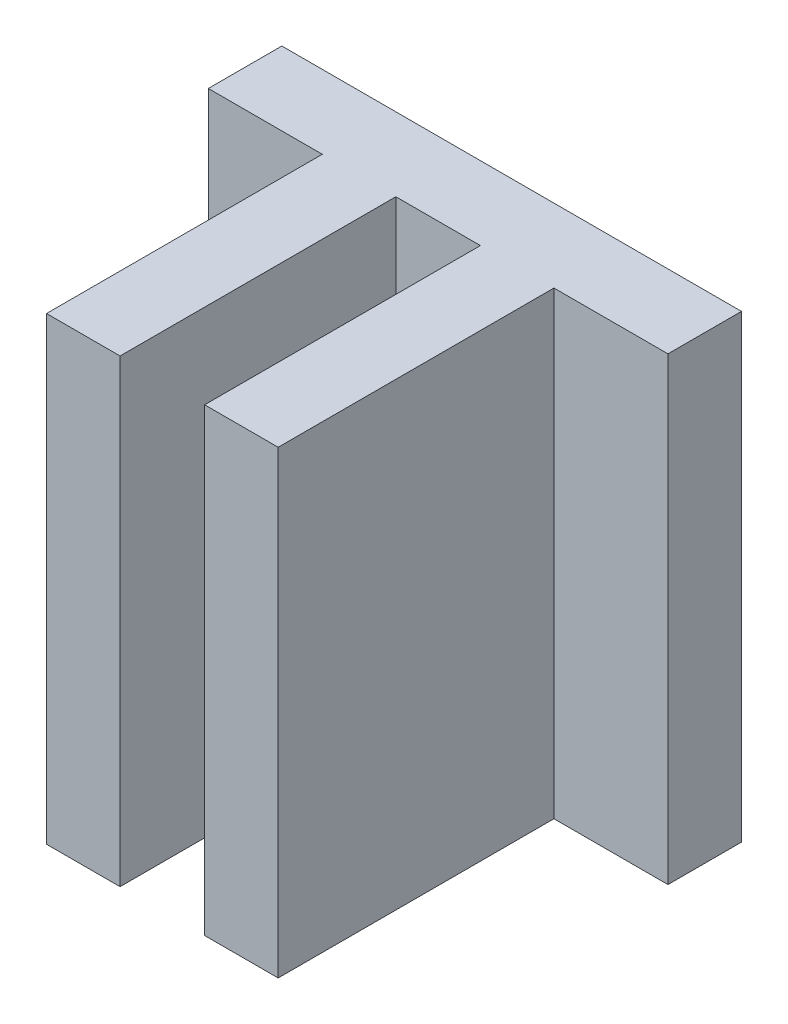
ISO-10303-21;
HEADER;
FILE_DESCRIPTION(('STEP AP214'),'2;1');
FILE_NAME('part.step','',(''),(''),'','','');
FILE_SCHEMA(('AUTOMOTIVE_DESIGN { 1 0 10303 214 1 1 1 1 }'));
ENDSEC;
DATA;
#1=APPLICATION_CONTEXT('core data for automotive mechanical design processes');
#2=APPLICATION_PROTOCOL_DEFINITION('international standard','automotive_design',2000,#1);
#3=PRODUCT_CONTEXT('',#1,'mechanical');
#4=PRODUCT('Part','Part','',(#3));
#5=PRODUCT_RELATED_PRODUCT_CATEGORY('part','',(#4));
#6=PRODUCT_DEFINITION_FORMATION('','',#4);
#7=PRODUCT_DEFINITION_CONTEXT('part definition',#1,'design');
#8=PRODUCT_DEFINITION('design','',#6,#7);
#9=PRODUCT_DEFINITION_SHAPE('','',#8);
#10=(LENGTH_UNIT() NAMED_UNIT(*) SI_UNIT(.MILLI.,.METRE.));
#11=(NAMED_UNIT(*) PLANE_ANGLE_UNIT() SI_UNIT($,.RADIAN.));
#12=(NAMED_UNIT(*) SI_UNIT($,.STERADIAN.) SOLID_ANGLE_UNIT());
#13=UNCERTAINTY_MEASURE_WITH_UNIT(LENGTH_MEASURE(1.E-05),#10,'distance_accuracy_value','');
#14=(GEOMETRIC_REPRESENTATION_CONTEXT(3) GLOBAL_UNCERTAINTY_ASSIGNED_CONTEXT((#13)) GLOBAL_UNIT_ASSIGNED_CONTEXT((#10,
#11,#12)) REPRESENTATION_CONTEXT('',''));
#15=CARTESIAN_POINT('',(0.,0.,0.));
#16=DIRECTION('',(0.,0.,1.));
#17=DIRECTION('',(1.,0.,0.));
#18=AXIS2_PLACEMENT_3D('',#15,#16,#17);
#19=CARTESIAN_POINT('',(1.4605,15.875,0.));
#20=DIRECTION('',(-1.,0.,0.));
#21=DIRECTION('',(0.,0.,1.));
#22=AXIS2_PLACEMENT_3D('',#19,#20,#21);
#23=PLANE('',#22);
#24=DIRECTION('',(0.,0.,-1.));
#25=VECTOR('',#24,1.);
#26=CARTESIAN_POINT('',(1.4605,0.,0.));
#27=LINE('',#26,#25);
#28=CARTESIAN_POINT('',(1.4605,0.,9.525));
#29=VERTEX_POINT('',#28);
#30=CARTESIAN_POINT('',(1.4605,0.,0.));
#31=VERTEX_POINT('',#30);
#32=EDGE_CURVE('E156',#29,#31,#27,.T.);
#33=ORIENTED_EDGE('',*,*,#32,.F.);
#34=DIRECTION('',(0.,-1.,0.));
#35=VECTOR('',#34,1.);
#36=CARTESIAN_POINT('',(1.4605,15.875,9.525));
#37=LINE('',#36,#35);
#38=CARTESIAN_POINT('',(1.4605,15.875,9.525));
#39=VERTEX_POINT('',#38);
#40=EDGE_CURVE('E11',#39,#29,#37,.T.);
#41=ORIENTED_EDGE('',*,*,#40,.F.);
#42=DIRECTION('',(0.,0.,-1.));
#43=VECTOR('',#42,1.);
#44=CARTESIAN_POINT('',(1.4605,15.875,0.));
#45=LINE('',#44,#43);
#46=CARTESIAN_POINT('',(1.4605,15.875,0.));
#47=VERTEX_POINT('',#46);
#48=EDGE_CURVE('E184',#39,#47,#45,.T.);
#49=ORIENTED_EDGE('',*,*,#48,.T.);
#50=DIRECTION('',(0.,-1.,0.));
#51=VECTOR('',#50,1.);
#52=CARTESIAN_POINT('',(1.4605,15.875,0.));
#53=LINE('',#52,#51);
#54=EDGE_CURVE('E99',#47,#31,#53,.T.);
#55=ORIENTED_EDGE('',*,*,#54,.T.);
#56=EDGE_LOOP('',(#33,#41,#49,#55));
#57=FACE_BOUND('',#56,.T.);
#58=ADVANCED_FACE('F36',(#57),#23,.T.);
#59=CARTESIAN_POINT('',(0.,15.875,9.525));
#60=DIRECTION('',(0.,0.,-1.));
#61=DIRECTION('',(-1.,0.,0.));
#62=AXIS2_PLACEMENT_3D('',#59,#60,#61);
#63=PLANE('',#62);
#64=DIRECTION('',(1.,0.,0.));
#65=VECTOR('',#64,1.);
#66=CARTESIAN_POINT('',(0.,0.,9.525));
#67=LINE('',#66,#65);
#68=CARTESIAN_POINT('',(4.0005,0.,9.525));
#69=VERTEX_POINT('',#68);
#70=EDGE_CURVE('E159',#29,#69,#67,.T.);
#71=ORIENTED_EDGE('',*,*,#70,.T.);
#72=DIRECTION('',(0.,-1.,0.));
#73=VECTOR('',#72,1.);
#74=CARTESIAN_POINT('',(4.0005,15.875,9.525));
#75=LINE('',#74,#73);
#76=CARTESIAN_POINT('',(4.0005,15.875,9.525));
#77=VERTEX_POINT('',#76);
#78=EDGE_CURVE('E44',#77,#69,#75,.T.);
#79=ORIENTED_EDGE('',*,*,#78,.F.);
#80=DIRECTION('',(1.,0.,0.));
#81=VECTOR('',#80,1.);
#82=CARTESIAN_POINT('',(0.,15.875,9.525));
#83=LINE('',#82,#81);
#84=EDGE_CURVE('E142',#39,#77,#83,.T.);
#85=ORIENTED_EDGE('',*,*,#84,.F.);
#86=ORIENTED_EDGE('',*,*,#40,.T.);
#87=EDGE_LOOP('',(#71,#79,#85,#86));
#88=FACE_BOUND('',#87,.T.);
#89=ADVANCED_FACE('F209',(#88),#63,.F.);
#90=CARTESIAN_POINT('',(4.0005,15.875,0.));
#91=DIRECTION('',(1.,0.,0.));
#92=DIRECTION('',(0.,0.,-1.));
#93=AXIS2_PLACEMENT_3D('',#90,#91,#92);
#94=PLANE('',#93);
#95=DIRECTION('',(0.,0.,1.));
#96=VECTOR('',#95,1.);
#97=CARTESIAN_POINT('',(4.0005,0.,0.));
#98=LINE('',#97,#96);
#99=CARTESIAN_POINT('',(4.0005,0.,0.));
#100=VERTEX_POINT('',#99);
#101=EDGE_CURVE('E162',#100,#69,#98,.T.);
#102=ORIENTED_EDGE('',*,*,#101,.F.);
#103=DIRECTION('',(0.,-1.,0.));
#104=VECTOR('',#103,1.);
#105=CARTESIAN_POINT('',(4.0005,15.875,0.));
#106=LINE('',#105,#104);
#107=CARTESIAN_POINT('',(4.0005,15.875,0.));
#108=VERTEX_POINT('',#107);
#109=EDGE_CURVE('E199',#108,#100,#106,.T.);
#110=ORIENTED_EDGE('',*,*,#109,.F.);
#111=DIRECTION('',(0.,0.,1.));
#112=VECTOR('',#111,1.);
#113=CARTESIAN_POINT('',(4.0005,15.875,0.));
#114=LINE('',#113,#112);
#115=EDGE_CURVE('E206',#108,#77,#114,.T.);
#116=ORIENTED_EDGE('',*,*,#115,.T.);
#117=ORIENTED_EDGE('',*,*,#78,.T.);
#118=EDGE_LOOP('',(#102,#110,#116,#117));
#119=FACE_BOUND('',#118,.T.);
#120=ADVANCED_FACE('F204',(#119),#94,.T.);
#121=CARTESIAN_POINT('',(0.,15.875,0.));
#122=DIRECTION('',(0.,0.,-1.));
#123=DIRECTION('',(-1.,0.,0.));
#124=AXIS2_PLACEMENT_3D('',#121,#122,#123);
#125=PLANE('',#124);
#126=DIRECTION('',(1.,0.,0.));
#127=VECTOR('',#126,1.);
#128=CARTESIAN_POINT('',(0.,0.,0.));
#129=LINE('',#128,#127);
#130=CARTESIAN_POINT('',(7.9375,0.,0.));
#131=VERTEX_POINT('',#130);
#132=EDGE_CURVE('E165',#100,#131,#129,.T.);
#133=ORIENTED_EDGE('',*,*,#132,.T.);
#134=DIRECTION('',(0.,-1.,0.));
#135=VECTOR('',#134,1.);
#136=CARTESIAN_POINT('',(7.9375,15.875,0.));
#137=LINE('',#136,#135);
#138=CARTESIAN_POINT('',(7.9375,15.875,0.));
#139=VERTEX_POINT('',#138);
#140=EDGE_CURVE('E196',#139,#131,#137,.T.);
#141=ORIENTED_EDGE('',*,*,#140,.F.);
#142=DIRECTION('',(1.,0.,0.));
#143=VECTOR('',#142,1.);
#144=CARTESIAN_POINT('',(0.,15.875,0.));
#145=LINE('',#144,#143);
#146=EDGE_CURVE('E226',#108,#139,#145,.T.);
#147=ORIENTED_EDGE('',*,*,#146,.F.);
#148=ORIENTED_EDGE('',*,*,#109,.T.);
#149=EDGE_LOOP('',(#133,#141,#147,#148));
#150=FACE_BOUND('',#149,.T.);
#151=ADVANCED_FACE('F216',(#150),#125,.F.);
#152=CARTESIAN_POINT('',(7.9375,15.875,0.));
#153=DIRECTION('',(-1.,0.,0.));
#154=DIRECTION('',(0.,0.,1.));
#155=AXIS2_PLACEMENT_3D('',#152,#153,#154);
#156=PLANE('',#155);
#157=DIRECTION('',(0.,0.,-1.));
#158=VECTOR('',#157,1.);
#159=CARTESIAN_POINT('',(7.9375,0.,0.));
#160=LINE('',#159,#158);
#161=CARTESIAN_POINT('',(7.9375,0.,-2.54));
#162=VERTEX_POINT('',#161);
#163=EDGE_CURVE('E167',#131,#162,#160,.T.);
#164=ORIENTED_EDGE('',*,*,#163,.T.);
#165=DIRECTION('',(0.,-1.,0.));
#166=VECTOR('',#165,1.);
#167=CARTESIAN_POINT('',(7.9375,15.875,-2.54));
#168=LINE('',#167,#166);
#169=CARTESIAN_POINT('',(7.9375,15.875,-2.54));
#170=VERTEX_POINT('',#169);
#171=EDGE_CURVE('E194',#170,#162,#168,.T.);
#172=ORIENTED_EDGE('',*,*,#171,.F.);
#173=DIRECTION('',(0.,0.,-1.));
#174=VECTOR('',#173,1.);
#175=CARTESIAN_POINT('',(7.9375,15.875,0.));
#176=LINE('',#175,#174);
#177=EDGE_CURVE('E222',#139,#170,#176,.T.);
#178=ORIENTED_EDGE('',*,*,#177,.F.);
#179=ORIENTED_EDGE('',*,*,#140,.T.);
#180=EDGE_LOOP('',(#164,#172,#178,#179));
#181=FACE_BOUND('',#180,.T.);
#182=ADVANCED_FACE('F220',(#181),#156,.F.);
#183=CARTESIAN_POINT('',(0.,15.875,-2.54));
#184=DIRECTION('',(0.,0.,-1.));
#185=DIRECTION('',(-1.,0.,0.));
#186=AXIS2_PLACEMENT_3D('',#183,#184,#185);
#187=PLANE('',#186);
#188=DIRECTION('',(1.,0.,0.));
#189=VECTOR('',#188,1.);
#190=CARTESIAN_POINT('',(0.,0.,-2.54));
#191=LINE('',#190,#189);
#192=CARTESIAN_POINT('',(-7.9375,0.,-2.54));
#193=VERTEX_POINT('',#192);
#194=EDGE_CURVE('E170',#193,#162,#191,.T.);
#195=ORIENTED_EDGE('',*,*,#194,.F.);
#196=DIRECTION('',(0.,-1.,0.));
#197=VECTOR('',#196,1.);
#198=CARTESIAN_POINT('',(-7.9375,15.875,-2.54));
#199=LINE('',#198,#197);
#200=CARTESIAN_POINT('',(-7.9375,15.875,-2.54));
#201=VERTEX_POINT('',#200);
#202=EDGE_CURVE('E192',#201,#193,#199,.T.);
#203=ORIENTED_EDGE('',*,*,#202,.F.);
#204=DIRECTION('',(1.,0.,0.));
#205=VECTOR('',#204,1.);
#206=CARTESIAN_POINT('',(0.,15.875,-2.54));
#207=LINE('',#206,#205);
#208=EDGE_CURVE('E225',#201,#170,#207,.T.);
#209=ORIENTED_EDGE('',*,*,#208,.T.);
#210=ORIENTED_EDGE('',*,*,#171,.T.);
#211=EDGE_LOOP('',(#195,#203,#209,#210));
#212=FACE_BOUND('',#211,.T.);
#213=ADVANCED_FACE('F318',(#212),#187,.T.);
#214=CARTESIAN_POINT('',(-7.9375,15.875,0.));
#215=DIRECTION('',(-1.,0.,0.));
#216=DIRECTION('',(0.,0.,1.));
#217=AXIS2_PLACEMENT_3D('',#214,#215,#216);
#218=PLANE('',#217);
#219=DIRECTION('',(0.,0.,-1.));
#220=VECTOR('',#219,1.);
#221=CARTESIAN_POINT('',(-7.9375,0.,0.));
#222=LINE('',#221,#220);
#223=CARTESIAN_POINT('',(-7.9375,0.,0.));
#224=VERTEX_POINT('',#223);
#225=EDGE_CURVE('E173',#224,#193,#222,.T.);
#226=ORIENTED_EDGE('',*,*,#225,.F.);
#227=DIRECTION('',(0.,-1.,0.));
#228=VECTOR('',#227,1.);
#229=CARTESIAN_POINT('',(-7.9375,15.875,0.));
#230=LINE('',#229,#228);
#231=CARTESIAN_POINT('',(-7.9375,15.875,0.));
#232=VERTEX_POINT('',#231);
#233=EDGE_CURVE('E190',#232,#224,#230,.T.);
#234=ORIENTED_EDGE('',*,*,#233,.F.);
#235=DIRECTION('',(0.,0.,-1.));
#236=VECTOR('',#235,1.);
#237=CARTESIAN_POINT('',(-7.9375,15.875,0.));
#238=LINE('',#237,#236);
#239=EDGE_CURVE('E228',#232,#201,#238,.T.);
#240=ORIENTED_EDGE('',*,*,#239,.T.);
#241=ORIENTED_EDGE('',*,*,#202,.T.);
#242=EDGE_LOOP('',(#226,#234,#240,#241));
#243=FACE_BOUND('',#242,.T.);
#244=ADVANCED_FACE('F242',(#243),#218,.T.);
#245=CARTESIAN_POINT('',(0.,15.875,0.));
#246=DIRECTION('',(0.,0.,1.));
#247=DIRECTION('',(1.,0.,0.));
#248=AXIS2_PLACEMENT_3D('',#245,#246,#247);
#249=PLANE('',#248);
#250=DIRECTION('',(-1.,0.,0.));
#251=VECTOR('',#250,1.);
#252=CARTESIAN_POINT('',(0.,0.,0.));
#253=LINE('',#252,#251);
#254=CARTESIAN_POINT('',(-4.0005,0.,0.));
#255=VERTEX_POINT('',#254);
#256=EDGE_CURVE('E176',#255,#224,#253,.T.);
#257=ORIENTED_EDGE('',*,*,#256,.F.);
#258=DIRECTION('',(0.,-1.,0.));
#259=VECTOR('',#258,1.);
#260=CARTESIAN_POINT('',(-4.0005,15.875,0.));
#261=LINE('',#260,#259);
#262=CARTESIAN_POINT('',(-4.0005,15.875,0.));
#263=VERTEX_POINT('',#262);
#264=EDGE_CURVE('E188',#263,#255,#261,.T.);
#265=ORIENTED_EDGE('',*,*,#264,.F.);
#266=DIRECTION('',(-1.,0.,0.));
#267=VECTOR('',#266,1.);
#268=CARTESIAN_POINT('',(0.,15.875,0.));
#269=LINE('',#268,#267);
#270=EDGE_CURVE('E234',#263,#232,#269,.T.);
#271=ORIENTED_EDGE('',*,*,#270,.T.);
#272=ORIENTED_EDGE('',*,*,#233,.T.);
#273=EDGE_LOOP('',(#257,#265,#271,#272));
#274=FACE_BOUND('',#273,.T.);
#275=ADVANCED_FACE('F238',(#274),#249,.T.);
#276=CARTESIAN_POINT('',(-4.0005,15.875,0.));
#277=DIRECTION('',(1.,0.,0.));
#278=DIRECTION('',(0.,0.,-1.));
#279=AXIS2_PLACEMENT_3D('',#276,#277,#278);
#280=PLANE('',#279);
#281=DIRECTION('',(0.,0.,1.));
#282=VECTOR('',#281,1.);
#283=CARTESIAN_POINT('',(-4.0005,0.,0.));
#284=LINE('',#283,#282);
#285=CARTESIAN_POINT('',(-4.0005,0.,9.525));
#286=VERTEX_POINT('',#285);
#287=EDGE_CURVE('E179',#255,#286,#284,.T.);
#288=ORIENTED_EDGE('',*,*,#287,.T.);
#289=DIRECTION('',(0.,-1.,0.));
#290=VECTOR('',#289,1.);
#291=CARTESIAN_POINT('',(-4.0005,15.875,9.525));
#292=LINE('',#291,#290);
#293=CARTESIAN_POINT('',(-4.0005,15.875,9.525));
#294=VERTEX_POINT('',#293);
#295=EDGE_CURVE('E147',#294,#286,#292,.T.);
#296=ORIENTED_EDGE('',*,*,#295,.F.);
#297=DIRECTION('',(0.,0.,1.));
#298=VECTOR('',#297,1.);
#299=CARTESIAN_POINT('',(-4.0005,15.875,0.));
#300=LINE('',#299,#298);
#301=EDGE_CURVE('E137',#263,#294,#300,.T.);
#302=ORIENTED_EDGE('',*,*,#301,.F.);
#303=ORIENTED_EDGE('',*,*,#264,.T.);
#304=EDGE_LOOP('',(#288,#296,#302,#303));
#305=FACE_BOUND('',#304,.T.);
#306=ADVANCED_FACE('F246',(#305),#280,.F.);
#307=CARTESIAN_POINT('',(-1.4605,0.,9.525));
#308=VERTEX_POINT('',#307);
#309=EDGE_CURVE('E146',#286,#308,#67,.T.);
#310=ORIENTED_EDGE('',*,*,#309,.T.);
#311=DIRECTION('',(0.,-1.,0.));
#312=VECTOR('',#311,1.);
#313=CARTESIAN_POINT('',(-1.4605,15.875,9.525));
#314=LINE('',#313,#312);
#315=CARTESIAN_POINT('',(-1.4605,15.875,9.525));
#316=VERTEX_POINT('',#315);
#317=EDGE_CURVE('E143',#316,#308,#314,.T.);
#318=ORIENTED_EDGE('',*,*,#317,.F.);
#319=EDGE_CURVE('E130',#294,#316,#83,.T.);
#320=ORIENTED_EDGE('',*,*,#319,.F.);
#321=ORIENTED_EDGE('',*,*,#295,.T.);
#322=EDGE_LOOP('',(#310,#318,#320,#321));
#323=FACE_BOUND('',#322,.T.);
#324=ADVANCED_FACE('F144',(#323),#63,.F.);
#325=CARTESIAN_POINT('',(-1.4605,15.875,0.));
#326=DIRECTION('',(-1.,0.,0.));
#327=DIRECTION('',(0.,0.,1.));
#328=AXIS2_PLACEMENT_3D('',#325,#326,#327);
#329=PLANE('',#328);
#330=DIRECTION('',(0.,0.,-1.));
#331=VECTOR('',#330,1.);
#332=CARTESIAN_POINT('',(-1.4605,0.,0.));
#333=LINE('',#332,#331);
#334=CARTESIAN_POINT('',(-1.4605,0.,0.));
#335=VERTEX_POINT('',#334);
#336=EDGE_CURVE('E92',#308,#335,#333,.T.);
#337=ORIENTED_EDGE('',*,*,#336,.T.);
#338=DIRECTION('',(0.,-1.,0.));
#339=VECTOR('',#338,1.);
#340=CARTESIAN_POINT('',(-1.4605,15.875,0.));
#341=LINE('',#340,#339);
#342=CARTESIAN_POINT('',(-1.4605,15.875,0.));
#343=VERTEX_POINT('',#342);
#344=EDGE_CURVE('E148',#343,#335,#341,.T.);
#345=ORIENTED_EDGE('',*,*,#344,.F.);
#346=DIRECTION('',(0.,0.,-1.));
#347=VECTOR('',#346,1.);
#348=CARTESIAN_POINT('',(-1.4605,15.875,0.));
#349=LINE('',#348,#347);
#350=EDGE_CURVE('E134',#316,#343,#349,.T.);
#351=ORIENTED_EDGE('',*,*,#350,.F.);
#352=ORIENTED_EDGE('',*,*,#317,.T.);
#353=EDGE_LOOP('',(#337,#345,#351,#352));
#354=FACE_BOUND('',#353,.T.);
#355=ADVANCED_FACE('F150',(#354),#329,.F.);
#356=CARTESIAN_POINT('',(0.,15.875,0.));
#357=DIRECTION('',(0.,0.,-1.));
#358=DIRECTION('',(-1.,0.,0.));
#359=AXIS2_PLACEMENT_3D('',#356,#357,#358);
#360=PLANE('',#359);
#361=DIRECTION('',(1.,0.,0.));
#362=VECTOR('',#361,1.);
#363=CARTESIAN_POINT('',(0.,0.,0.));
#364=LINE('',#363,#362);
#365=EDGE_CURVE('E182',#335,#31,#364,.T.);
#366=ORIENTED_EDGE('',*,*,#365,.T.);
#367=ORIENTED_EDGE('',*,*,#54,.F.);
#368=DIRECTION('',(1.,0.,0.));
#369=VECTOR('',#368,1.);
#370=CARTESIAN_POINT('',(0.,15.875,0.));
#371=LINE('',#370,#369);
#372=EDGE_CURVE('E52',#343,#47,#371,.T.);
#373=ORIENTED_EDGE('',*,*,#372,.F.);
#374=ORIENTED_EDGE('',*,*,#344,.T.);
#375=EDGE_LOOP('',(#366,#367,#373,#374));
#376=FACE_BOUND('',#375,.T.);
#377=ADVANCED_FACE('F261',(#376),#360,.F.);
#378=CARTESIAN_POINT('',(0.,15.875,0.));
#379=DIRECTION('',(0.,1.,0.));
#380=DIRECTION('',(0.,0.,1.));
#381=AXIS2_PLACEMENT_3D('',#378,#379,#380);
#382=PLANE('',#381);
#383=ORIENTED_EDGE('',*,*,#48,.F.);
#384=ORIENTED_EDGE('',*,*,#84,.T.);
#385=ORIENTED_EDGE('',*,*,#115,.F.);
#386=ORIENTED_EDGE('',*,*,#146,.T.);
#387=ORIENTED_EDGE('',*,*,#177,.T.);
#388=ORIENTED_EDGE('',*,*,#208,.F.);
#389=ORIENTED_EDGE('',*,*,#239,.F.);
#390=ORIENTED_EDGE('',*,*,#270,.F.);
#391=ORIENTED_EDGE('',*,*,#301,.T.);
#392=ORIENTED_EDGE('',*,*,#319,.T.);
#393=ORIENTED_EDGE('',*,*,#350,.T.);
#394=ORIENTED_EDGE('',*,*,#372,.T.);
#395=EDGE_LOOP('',(#383,#384,#385,#386,#387,#388,#389,#390,#391,#392,#393,#394));
#396=FACE_BOUND('',#395,.T.);
#397=ADVANCED_FACE('F132',(#396),#382,.T.);
#398=CARTESIAN_POINT('',(0.,0.,0.));
#399=DIRECTION('',(0.,1.,0.));
#400=DIRECTION('',(0.,0.,1.));
#401=AXIS2_PLACEMENT_3D('',#398,#399,#400);
#402=PLANE('',#401);
#403=ORIENTED_EDGE('',*,*,#32,.T.);
#404=ORIENTED_EDGE('',*,*,#365,.F.);
#405=ORIENTED_EDGE('',*,*,#336,.F.);
#406=ORIENTED_EDGE('',*,*,#309,.F.);
#407=ORIENTED_EDGE('',*,*,#287,.F.);
#408=ORIENTED_EDGE('',*,*,#256,.T.);
#409=ORIENTED_EDGE('',*,*,#225,.T.);
#410=ORIENTED_EDGE('',*,*,#194,.T.);
#411=ORIENTED_EDGE('',*,*,#163,.F.);
#412=ORIENTED_EDGE('',*,*,#132,.F.);
#413=ORIENTED_EDGE('',*,*,#101,.T.);
#414=ORIENTED_EDGE('',*,*,#70,.F.);
#415=EDGE_LOOP('',(#403,#404,#405,#406,#407,#408,#409,#410,#411,#412,#413,#414));
#416=FACE_BOUND('',#415,.T.);
#417=ADVANCED_FACE('F212',(#416),#402,.F.);
#418=CLOSED_SHELL('',(#58,#89,#120,#151,#182,#213,#244,#275,#306,#324,#355,#377,#397,#417));
#419=MANIFOLD_SOLID_BREP('B2',#418);
#420=ADVANCED_BREP_SHAPE_REPRESENTATION('',(#18,#419),#14);
#421=SHAPE_DEFINITION_REPRESENTATION(#9,#420);
ENDSEC;
END-ISO-10303-21;
